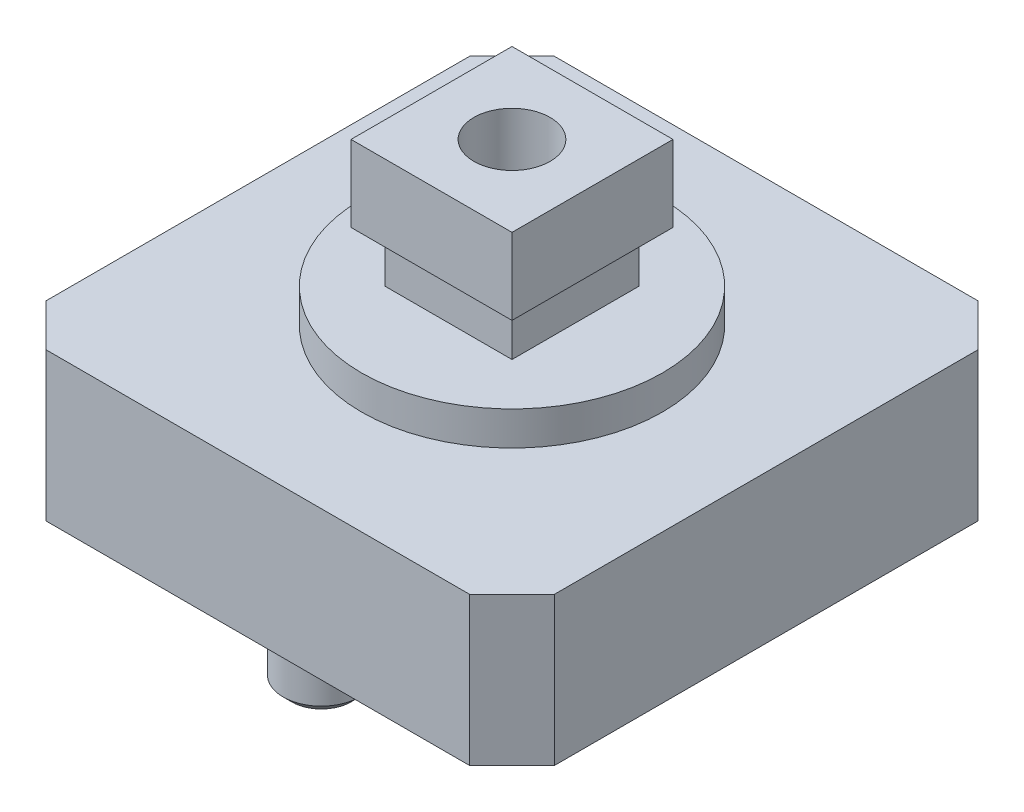
ISO-10303-21;
HEADER;
FILE_DESCRIPTION(('STEP AP214'),'2;1');
FILE_NAME('part.step','',(''),(''),'','','');
FILE_SCHEMA(('AUTOMOTIVE_DESIGN { 1 0 10303 214 1 1 1 1 }'));
ENDSEC;
DATA;
#1=APPLICATION_CONTEXT('core data for automotive mechanical design processes');
#2=APPLICATION_PROTOCOL_DEFINITION('international standard','automotive_design',2000,#1);
#3=PRODUCT_CONTEXT('',#1,'mechanical');
#4=PRODUCT('Part','Part','',(#3));
#5=PRODUCT_RELATED_PRODUCT_CATEGORY('part','',(#4));
#6=PRODUCT_DEFINITION_FORMATION('','',#4);
#7=PRODUCT_DEFINITION_CONTEXT('part definition',#1,'design');
#8=PRODUCT_DEFINITION('design','',#6,#7);
#9=PRODUCT_DEFINITION_SHAPE('','',#8);
#10=(LENGTH_UNIT() NAMED_UNIT(*) SI_UNIT(.MILLI.,.METRE.));
#11=(NAMED_UNIT(*) PLANE_ANGLE_UNIT() SI_UNIT($,.RADIAN.));
#12=(NAMED_UNIT(*) SI_UNIT($,.STERADIAN.) SOLID_ANGLE_UNIT());
#13=UNCERTAINTY_MEASURE_WITH_UNIT(LENGTH_MEASURE(1.E-05),#10,'distance_accuracy_value','');
#14=(GEOMETRIC_REPRESENTATION_CONTEXT(3) GLOBAL_UNCERTAINTY_ASSIGNED_CONTEXT((#13)) GLOBAL_UNIT_ASSIGNED_CONTEXT((#10,
#11,#12)) REPRESENTATION_CONTEXT('',''));
#15=CARTESIAN_POINT('',(0.,0.,0.));
#16=DIRECTION('',(0.,0.,1.));
#17=DIRECTION('',(1.,0.,0.));
#18=AXIS2_PLACEMENT_3D('',#15,#16,#17);
#19=CARTESIAN_POINT('',(0.,4.3,0.));
#20=DIRECTION('',(0.,1.,0.));
#21=DIRECTION('',(0.,0.,1.));
#22=AXIS2_PLACEMENT_3D('',#19,#20,#21);
#23=PLANE('',#22);
#24=CARTESIAN_POINT('',(0.,4.3,0.));
#25=DIRECTION('',(0.,1.,0.));
#26=DIRECTION('',(0.,0.,1.));
#27=AXIS2_PLACEMENT_3D('',#24,#25,#26);
#28=CIRCLE('',#27,3.55);
#29=CARTESIAN_POINT('',(0.,4.3,3.55));
#30=VERTEX_POINT('',#29);
#31=EDGE_CURVE('E274',#30,#30,#28,.T.);
#32=ORIENTED_EDGE('',*,*,#31,.T.);
#33=EDGE_LOOP('',(#32));
#34=FACE_BOUND('',#33,.T.);
#35=DIRECTION('',(1.,0.,0.));
#36=VECTOR('',#35,1.);
#37=CARTESIAN_POINT('',(1.5,4.3,1.5));
#38=LINE('',#37,#36);
#39=CARTESIAN_POINT('',(-1.5,4.3,1.5));
#40=VERTEX_POINT('',#39);
#41=CARTESIAN_POINT('',(1.5,4.3,1.5));
#42=VERTEX_POINT('',#41);
#43=EDGE_CURVE('E310',#40,#42,#38,.T.);
#44=ORIENTED_EDGE('',*,*,#43,.F.);
#45=DIRECTION('',(0.,0.,1.));
#46=VECTOR('',#45,1.);
#47=CARTESIAN_POINT('',(-1.5,4.3,1.5));
#48=LINE('',#47,#46);
#49=CARTESIAN_POINT('',(-1.5,4.3,-1.5));
#50=VERTEX_POINT('',#49);
#51=EDGE_CURVE('E313',#50,#40,#48,.T.);
#52=ORIENTED_EDGE('',*,*,#51,.F.);
#53=DIRECTION('',(-1.,0.,0.));
#54=VECTOR('',#53,1.);
#55=CARTESIAN_POINT('',(1.5,4.3,-1.5));
#56=LINE('',#55,#54);
#57=CARTESIAN_POINT('',(1.5,4.3,-1.5));
#58=VERTEX_POINT('',#57);
#59=EDGE_CURVE('E305',#58,#50,#56,.T.);
#60=ORIENTED_EDGE('',*,*,#59,.F.);
#61=DIRECTION('',(0.,0.,-1.));
#62=VECTOR('',#61,1.);
#63=CARTESIAN_POINT('',(1.5,4.3,1.5));
#64=LINE('',#63,#62);
#65=EDGE_CURVE('E308',#42,#58,#64,.T.);
#66=ORIENTED_EDGE('',*,*,#65,.F.);
#67=EDGE_LOOP('',(#44,#52,#60,#66));
#68=FACE_BOUND('',#67,.T.);
#69=ADVANCED_FACE('F32',(#34,#68),#23,.T.);
#70=CARTESIAN_POINT('',(0.,3.5,0.));
#71=DIRECTION('',(0.,-1.,0.));
#72=DIRECTION('',(0.,0.,-1.));
#73=AXIS2_PLACEMENT_3D('',#70,#71,#72);
#74=PLANE('',#73);
#75=DIRECTION('',(-1.,0.,0.));
#76=VECTOR('',#75,1.);
#77=CARTESIAN_POINT('',(-5.,3.5,-6.));
#78=LINE('',#77,#76);
#79=CARTESIAN_POINT('',(5.,3.5,-6.));
#80=VERTEX_POINT('',#79);
#81=CARTESIAN_POINT('',(-5.,3.5,-6.));
#82=VERTEX_POINT('',#81);
#83=EDGE_CURVE('E159',#80,#82,#78,.T.);
#84=ORIENTED_EDGE('',*,*,#83,.T.);
#85=DIRECTION('',(-0.707106781186548,0.,0.707106781186548));
#86=VECTOR('',#85,1.);
#87=CARTESIAN_POINT('',(-6.,3.5,-5.));
#88=LINE('',#87,#86);
#89=CARTESIAN_POINT('',(-6.,3.5,-5.));
#90=VERTEX_POINT('',#89);
#91=EDGE_CURVE('E98',#82,#90,#88,.T.);
#92=ORIENTED_EDGE('',*,*,#91,.T.);
#93=DIRECTION('',(0.,0.,1.));
#94=VECTOR('',#93,1.);
#95=CARTESIAN_POINT('',(-6.,3.5,-5.));
#96=LINE('',#95,#94);
#97=CARTESIAN_POINT('',(-6.,3.5,5.));
#98=VERTEX_POINT('',#97);
#99=EDGE_CURVE('E283',#90,#98,#96,.T.);
#100=ORIENTED_EDGE('',*,*,#99,.T.);
#101=DIRECTION('',(0.707106781186548,0.,0.707106781186548));
#102=VECTOR('',#101,1.);
#103=CARTESIAN_POINT('',(-6.,3.5,5.));
#104=LINE('',#103,#102);
#105=CARTESIAN_POINT('',(-5.,3.5,6.));
#106=VERTEX_POINT('',#105);
#107=EDGE_CURVE('E285',#98,#106,#104,.T.);
#108=ORIENTED_EDGE('',*,*,#107,.T.);
#109=DIRECTION('',(1.,0.,0.));
#110=VECTOR('',#109,1.);
#111=CARTESIAN_POINT('',(-5.,3.5,6.));
#112=LINE('',#111,#110);
#113=CARTESIAN_POINT('',(5.,3.5,6.));
#114=VERTEX_POINT('',#113);
#115=EDGE_CURVE('E122',#106,#114,#112,.T.);
#116=ORIENTED_EDGE('',*,*,#115,.T.);
#117=DIRECTION('',(0.707106781186548,0.,-0.707106781186548));
#118=VECTOR('',#117,1.);
#119=CARTESIAN_POINT('',(5.,3.5,6.));
#120=LINE('',#119,#118);
#121=CARTESIAN_POINT('',(6.,3.5,5.));
#122=VERTEX_POINT('',#121);
#123=EDGE_CURVE('E114',#114,#122,#120,.T.);
#124=ORIENTED_EDGE('',*,*,#123,.T.);
#125=DIRECTION('',(0.,0.,-1.));
#126=VECTOR('',#125,1.);
#127=CARTESIAN_POINT('',(6.,3.5,-5.));
#128=LINE('',#127,#126);
#129=CARTESIAN_POINT('',(6.,3.5,-5.));
#130=VERTEX_POINT('',#129);
#131=EDGE_CURVE('E119',#122,#130,#128,.T.);
#132=ORIENTED_EDGE('',*,*,#131,.T.);
#133=DIRECTION('',(-0.707106781186548,0.,-0.707106781186548));
#134=VECTOR('',#133,1.);
#135=CARTESIAN_POINT('',(5.,3.5,-6.));
#136=LINE('',#135,#134);
#137=EDGE_CURVE('E56',#130,#80,#136,.T.);
#138=ORIENTED_EDGE('',*,*,#137,.T.);
#139=EDGE_LOOP('',(#84,#92,#100,#108,#116,#124,#132,#138));
#140=FACE_BOUND('',#139,.T.);
#141=CARTESIAN_POINT('',(0.,3.5,0.));
#142=DIRECTION('',(0.,-1.,0.));
#143=DIRECTION('',(0.,0.,-1.));
#144=AXIS2_PLACEMENT_3D('',#141,#142,#143);
#145=CIRCLE('',#144,3.55);
#146=CARTESIAN_POINT('',(0.,3.5,-3.55));
#147=VERTEX_POINT('',#146);
#148=EDGE_CURVE('E11',#147,#147,#145,.F.);
#149=ORIENTED_EDGE('',*,*,#148,.F.);
#150=EDGE_LOOP('',(#149));
#151=FACE_BOUND('',#150,.T.);
#152=ADVANCED_FACE('F116',(#140,#151),#74,.F.);
#153=CARTESIAN_POINT('',(0.,0.,0.));
#154=DIRECTION('',(0.,-1.,0.));
#155=DIRECTION('',(0.,0.,-1.));
#156=AXIS2_PLACEMENT_3D('',#153,#154,#155);
#157=PLANE('',#156);
#158=CARTESIAN_POINT('',(0.,0.,-4.5));
#159=DIRECTION('',(0.,-1.,0.));
#160=DIRECTION('',(0.,0.,-1.));
#161=AXIS2_PLACEMENT_3D('',#158,#159,#160);
#162=CIRCLE('',#161,0.9);
#163=CARTESIAN_POINT('',(0.,0.,-5.4));
#164=VERTEX_POINT('',#163);
#165=EDGE_CURVE('E147',#164,#164,#162,.T.);
#166=ORIENTED_EDGE('',*,*,#165,.F.);
#167=EDGE_LOOP('',(#166));
#168=FACE_BOUND('',#167,.T.);
#169=DIRECTION('',(-1.,0.,0.));
#170=VECTOR('',#169,1.);
#171=CARTESIAN_POINT('',(-5.,0.,-6.));
#172=LINE('',#171,#170);
#173=CARTESIAN_POINT('',(5.,0.,-6.));
#174=VERTEX_POINT('',#173);
#175=CARTESIAN_POINT('',(-5.,0.,-6.));
#176=VERTEX_POINT('',#175);
#177=EDGE_CURVE('E143',#174,#176,#172,.T.);
#178=ORIENTED_EDGE('',*,*,#177,.F.);
#179=DIRECTION('',(-0.707106781186548,0.,-0.707106781186548));
#180=VECTOR('',#179,1.);
#181=CARTESIAN_POINT('',(5.,0.,-6.));
#182=LINE('',#181,#180);
#183=CARTESIAN_POINT('',(6.,0.,-5.));
#184=VERTEX_POINT('',#183);
#185=EDGE_CURVE('E89',#184,#174,#182,.T.);
#186=ORIENTED_EDGE('',*,*,#185,.F.);
#187=DIRECTION('',(0.,0.,-1.));
#188=VECTOR('',#187,1.);
#189=CARTESIAN_POINT('',(6.,0.,-5.));
#190=LINE('',#189,#188);
#191=CARTESIAN_POINT('',(6.,0.,5.));
#192=VERTEX_POINT('',#191);
#193=EDGE_CURVE('E156',#192,#184,#190,.T.);
#194=ORIENTED_EDGE('',*,*,#193,.F.);
#195=DIRECTION('',(0.707106781186548,0.,-0.707106781186548));
#196=VECTOR('',#195,1.);
#197=CARTESIAN_POINT('',(5.,0.,6.));
#198=LINE('',#197,#196);
#199=CARTESIAN_POINT('',(5.,0.,6.));
#200=VERTEX_POINT('',#199);
#201=EDGE_CURVE('E131',#200,#192,#198,.T.);
#202=ORIENTED_EDGE('',*,*,#201,.F.);
#203=DIRECTION('',(1.,0.,0.));
#204=VECTOR('',#203,1.);
#205=CARTESIAN_POINT('',(-5.,0.,6.));
#206=LINE('',#205,#204);
#207=CARTESIAN_POINT('',(-5.,0.,6.));
#208=VERTEX_POINT('',#207);
#209=EDGE_CURVE('E153',#208,#200,#206,.T.);
#210=ORIENTED_EDGE('',*,*,#209,.F.);
#211=DIRECTION('',(0.707106781186548,0.,0.707106781186548));
#212=VECTOR('',#211,1.);
#213=CARTESIAN_POINT('',(-6.,0.,5.));
#214=LINE('',#213,#212);
#215=CARTESIAN_POINT('',(-6.,0.,5.));
#216=VERTEX_POINT('',#215);
#217=EDGE_CURVE('E151',#216,#208,#214,.T.);
#218=ORIENTED_EDGE('',*,*,#217,.F.);
#219=DIRECTION('',(0.,0.,1.));
#220=VECTOR('',#219,1.);
#221=CARTESIAN_POINT('',(-6.,0.,-5.));
#222=LINE('',#221,#220);
#223=CARTESIAN_POINT('',(-6.,0.,-5.));
#224=VERTEX_POINT('',#223);
#225=EDGE_CURVE('E149',#224,#216,#222,.T.);
#226=ORIENTED_EDGE('',*,*,#225,.F.);
#227=DIRECTION('',(-0.707106781186548,0.,0.707106781186548));
#228=VECTOR('',#227,1.);
#229=CARTESIAN_POINT('',(-6.,0.,-5.));
#230=LINE('',#229,#228);
#231=EDGE_CURVE('E146',#176,#224,#230,.T.);
#232=ORIENTED_EDGE('',*,*,#231,.F.);
#233=EDGE_LOOP('',(#178,#186,#194,#202,#210,#218,#226,#232));
#234=FACE_BOUND('',#233,.T.);
#235=CARTESIAN_POINT('',(0.,0.,4.5));
#236=DIRECTION('',(0.,-1.,0.));
#237=DIRECTION('',(0.,0.,1.));
#238=AXIS2_PLACEMENT_3D('',#235,#236,#237);
#239=CIRCLE('',#238,0.9);
#240=CARTESIAN_POINT('',(0.,0.,5.4));
#241=VERTEX_POINT('',#240);
#242=EDGE_CURVE('E272',#241,#241,#239,.T.);
#243=ORIENTED_EDGE('',*,*,#242,.F.);
#244=EDGE_LOOP('',(#243));
#245=FACE_BOUND('',#244,.T.);
#246=ADVANCED_FACE('F213',(#168,#234,#245),#157,.T.);
#247=CARTESIAN_POINT('',(-5.,3.5,-6.));
#248=DIRECTION('',(0.,0.,1.));
#249=DIRECTION('',(1.,0.,0.));
#250=AXIS2_PLACEMENT_3D('',#247,#248,#249);
#251=PLANE('',#250);
#252=ORIENTED_EDGE('',*,*,#177,.T.);
#253=DIRECTION('',(0.,-1.,0.));
#254=VECTOR('',#253,1.);
#255=CARTESIAN_POINT('',(-5.,3.5,-6.));
#256=LINE('',#255,#254);
#257=EDGE_CURVE('E172',#82,#176,#256,.T.);
#258=ORIENTED_EDGE('',*,*,#257,.F.);
#259=ORIENTED_EDGE('',*,*,#83,.F.);
#260=DIRECTION('',(0.,-1.,0.));
#261=VECTOR('',#260,1.);
#262=CARTESIAN_POINT('',(5.,3.5,-6.));
#263=LINE('',#262,#261);
#264=EDGE_CURVE('E139',#80,#174,#263,.T.);
#265=ORIENTED_EDGE('',*,*,#264,.T.);
#266=EDGE_LOOP('',(#252,#258,#259,#265));
#267=FACE_BOUND('',#266,.T.);
#268=ADVANCED_FACE('F236',(#267),#251,.F.);
#269=CARTESIAN_POINT('',(-6.,3.5,-5.));
#270=DIRECTION('',(0.707106781186547,0.,0.707106781186547));
#271=DIRECTION('',(0.707106781186548,0.,-0.707106781186548));
#272=AXIS2_PLACEMENT_3D('',#269,#270,#271);
#273=PLANE('',#272);
#274=ORIENTED_EDGE('',*,*,#231,.T.);
#275=DIRECTION('',(0.,-1.,0.));
#276=VECTOR('',#275,1.);
#277=CARTESIAN_POINT('',(-6.,3.5,-5.));
#278=LINE('',#277,#276);
#279=EDGE_CURVE('E169',#90,#224,#278,.T.);
#280=ORIENTED_EDGE('',*,*,#279,.F.);
#281=ORIENTED_EDGE('',*,*,#91,.F.);
#282=ORIENTED_EDGE('',*,*,#257,.T.);
#283=EDGE_LOOP('',(#274,#280,#281,#282));
#284=FACE_BOUND('',#283,.T.);
#285=ADVANCED_FACE('F239',(#284),#273,.F.);
#286=CARTESIAN_POINT('',(-6.,3.5,-5.));
#287=DIRECTION('',(1.,0.,0.));
#288=DIRECTION('',(0.,0.,-1.));
#289=AXIS2_PLACEMENT_3D('',#286,#287,#288);
#290=PLANE('',#289);
#291=ORIENTED_EDGE('',*,*,#225,.T.);
#292=DIRECTION('',(0.,-1.,0.));
#293=VECTOR('',#292,1.);
#294=CARTESIAN_POINT('',(-6.,3.5,5.));
#295=LINE('',#294,#293);
#296=EDGE_CURVE('E166',#98,#216,#295,.T.);
#297=ORIENTED_EDGE('',*,*,#296,.F.);
#298=ORIENTED_EDGE('',*,*,#99,.F.);
#299=ORIENTED_EDGE('',*,*,#279,.T.);
#300=EDGE_LOOP('',(#291,#297,#298,#299));
#301=FACE_BOUND('',#300,.T.);
#302=ADVANCED_FACE('F243',(#301),#290,.F.);
#303=CARTESIAN_POINT('',(-6.,3.5,5.));
#304=DIRECTION('',(0.707106781186547,0.,-0.707106781186547));
#305=DIRECTION('',(-0.707106781186548,0.,-0.707106781186548));
#306=AXIS2_PLACEMENT_3D('',#303,#304,#305);
#307=PLANE('',#306);
#308=ORIENTED_EDGE('',*,*,#217,.T.);
#309=DIRECTION('',(0.,-1.,0.));
#310=VECTOR('',#309,1.);
#311=CARTESIAN_POINT('',(-5.,3.5,6.));
#312=LINE('',#311,#310);
#313=EDGE_CURVE('E163',#106,#208,#312,.T.);
#314=ORIENTED_EDGE('',*,*,#313,.F.);
#315=ORIENTED_EDGE('',*,*,#107,.F.);
#316=ORIENTED_EDGE('',*,*,#296,.T.);
#317=EDGE_LOOP('',(#308,#314,#315,#316));
#318=FACE_BOUND('',#317,.T.);
#319=ADVANCED_FACE('F246',(#318),#307,.F.);
#320=CARTESIAN_POINT('',(-5.,3.5,6.));
#321=DIRECTION('',(0.,0.,-1.));
#322=DIRECTION('',(-1.,0.,0.));
#323=AXIS2_PLACEMENT_3D('',#320,#321,#322);
#324=PLANE('',#323);
#325=ORIENTED_EDGE('',*,*,#209,.T.);
#326=DIRECTION('',(0.,-1.,0.));
#327=VECTOR('',#326,1.);
#328=CARTESIAN_POINT('',(5.,3.5,6.));
#329=LINE('',#328,#327);
#330=EDGE_CURVE('E134',#114,#200,#329,.T.);
#331=ORIENTED_EDGE('',*,*,#330,.F.);
#332=ORIENTED_EDGE('',*,*,#115,.F.);
#333=ORIENTED_EDGE('',*,*,#313,.T.);
#334=EDGE_LOOP('',(#325,#331,#332,#333));
#335=FACE_BOUND('',#334,.T.);
#336=ADVANCED_FACE('F250',(#335),#324,.F.);
#337=CARTESIAN_POINT('',(5.,3.5,6.));
#338=DIRECTION('',(-0.707106781186547,0.,-0.707106781186547));
#339=DIRECTION('',(-0.707106781186548,0.,0.707106781186548));
#340=AXIS2_PLACEMENT_3D('',#337,#338,#339);
#341=PLANE('',#340);
#342=ORIENTED_EDGE('',*,*,#201,.T.);
#343=DIRECTION('',(0.,-1.,0.));
#344=VECTOR('',#343,1.);
#345=CARTESIAN_POINT('',(6.,3.5,5.));
#346=LINE('',#345,#344);
#347=EDGE_CURVE('E128',#122,#192,#346,.T.);
#348=ORIENTED_EDGE('',*,*,#347,.F.);
#349=ORIENTED_EDGE('',*,*,#123,.F.);
#350=ORIENTED_EDGE('',*,*,#330,.T.);
#351=EDGE_LOOP('',(#342,#348,#349,#350));
#352=FACE_BOUND('',#351,.T.);
#353=ADVANCED_FACE('F129',(#352),#341,.F.);
#354=CARTESIAN_POINT('',(6.,3.5,-5.));
#355=DIRECTION('',(-1.,0.,0.));
#356=DIRECTION('',(0.,0.,1.));
#357=AXIS2_PLACEMENT_3D('',#354,#355,#356);
#358=PLANE('',#357);
#359=ORIENTED_EDGE('',*,*,#193,.T.);
#360=DIRECTION('',(0.,-1.,0.));
#361=VECTOR('',#360,1.);
#362=CARTESIAN_POINT('',(6.,3.5,-5.));
#363=LINE('',#362,#361);
#364=EDGE_CURVE('E135',#130,#184,#363,.T.);
#365=ORIENTED_EDGE('',*,*,#364,.F.);
#366=ORIENTED_EDGE('',*,*,#131,.F.);
#367=ORIENTED_EDGE('',*,*,#347,.T.);
#368=EDGE_LOOP('',(#359,#365,#366,#367));
#369=FACE_BOUND('',#368,.T.);
#370=ADVANCED_FACE('F137',(#369),#358,.F.);
#371=CARTESIAN_POINT('',(5.,3.5,-6.));
#372=DIRECTION('',(-0.707106781186547,0.,0.707106781186547));
#373=DIRECTION('',(0.707106781186548,0.,0.707106781186548));
#374=AXIS2_PLACEMENT_3D('',#371,#372,#373);
#375=PLANE('',#374);
#376=ORIENTED_EDGE('',*,*,#185,.T.);
#377=ORIENTED_EDGE('',*,*,#264,.F.);
#378=ORIENTED_EDGE('',*,*,#137,.F.);
#379=ORIENTED_EDGE('',*,*,#364,.T.);
#380=EDGE_LOOP('',(#376,#377,#378,#379));
#381=FACE_BOUND('',#380,.T.);
#382=ADVANCED_FACE('F205',(#381),#375,.F.);
#383=CARTESIAN_POINT('',(0.,-1.6,-4.5));
#384=DIRECTION('',(0.,1.,0.));
#385=DIRECTION('',(0.,0.,1.));
#386=AXIS2_PLACEMENT_3D('',#383,#384,#385);
#387=CYLINDRICAL_SURFACE('',#386,0.9);
#388=CARTESIAN_POINT('',(0.,-1.4,-4.5));
#389=DIRECTION('',(0.,-1.,0.));
#390=DIRECTION('',(0.,0.,-1.));
#391=AXIS2_PLACEMENT_3D('',#388,#389,#390);
#392=CIRCLE('',#391,0.9);
#393=CARTESIAN_POINT('',(0.,-1.4,-5.4));
#394=VERTEX_POINT('',#393);
#395=EDGE_CURVE('E40',#394,#394,#392,.F.);
#396=ORIENTED_EDGE('',*,*,#395,.T.);
#397=EDGE_LOOP('',(#396));
#398=FACE_BOUND('',#397,.T.);
#399=ORIENTED_EDGE('',*,*,#165,.T.);
#400=EDGE_LOOP('',(#399));
#401=FACE_BOUND('',#400,.T.);
#402=ADVANCED_FACE('F185',(#398,#401),#387,.T.);
#403=CARTESIAN_POINT('',(0.,-1.6,-4.5));
#404=DIRECTION('',(0.,-1.,0.));
#405=DIRECTION('',(0.,0.,-1.));
#406=AXIS2_PLACEMENT_3D('',#403,#404,#405);
#407=PLANE('',#406);
#408=CARTESIAN_POINT('',(0.,-1.6,-4.5));
#409=DIRECTION('',(0.,-1.,0.));
#410=DIRECTION('',(0.,0.,-1.));
#411=AXIS2_PLACEMENT_3D('',#408,#409,#410);
#412=CIRCLE('',#411,0.699999999999999);
#413=CARTESIAN_POINT('',(0.,-1.6,-5.2));
#414=VERTEX_POINT('',#413);
#415=EDGE_CURVE('E180',#414,#414,#412,.T.);
#416=ORIENTED_EDGE('',*,*,#415,.T.);
#417=EDGE_LOOP('',(#416));
#418=FACE_BOUND('',#417,.T.);
#419=ADVANCED_FACE('F194',(#418),#407,.T.);
#420=CARTESIAN_POINT('',(0.,-1.6,4.5));
#421=DIRECTION('',(0.,1.,0.));
#422=DIRECTION('',(0.,0.,1.));
#423=AXIS2_PLACEMENT_3D('',#420,#421,#422);
#424=CYLINDRICAL_SURFACE('',#423,0.9);
#425=CARTESIAN_POINT('',(0.,-1.4,4.5));
#426=DIRECTION('',(0.,1.,0.));
#427=DIRECTION('',(0.,0.,1.));
#428=AXIS2_PLACEMENT_3D('',#425,#426,#427);
#429=CIRCLE('',#428,0.9);
#430=CARTESIAN_POINT('',(0.,-1.4,5.4));
#431=VERTEX_POINT('',#430);
#432=EDGE_CURVE('E177',#431,#431,#429,.T.);
#433=ORIENTED_EDGE('',*,*,#432,.T.);
#434=EDGE_LOOP('',(#433));
#435=FACE_BOUND('',#434,.T.);
#436=ORIENTED_EDGE('',*,*,#242,.T.);
#437=EDGE_LOOP('',(#436));
#438=FACE_BOUND('',#437,.T.);
#439=ADVANCED_FACE('F196',(#435,#438),#424,.T.);
#440=CARTESIAN_POINT('',(0.,-1.6,4.5));
#441=DIRECTION('',(0.,1.,0.));
#442=DIRECTION('',(0.,0.,1.));
#443=AXIS2_PLACEMENT_3D('',#440,#441,#442);
#444=PLANE('',#443);
#445=CARTESIAN_POINT('',(0.,-1.6,4.5));
#446=DIRECTION('',(0.,1.,0.));
#447=DIRECTION('',(0.,0.,1.));
#448=AXIS2_PLACEMENT_3D('',#445,#446,#447);
#449=CIRCLE('',#448,0.699999999999999);
#450=CARTESIAN_POINT('',(0.,-1.6,5.2));
#451=VERTEX_POINT('',#450);
#452=EDGE_CURVE('E174',#451,#451,#449,.F.);
#453=ORIENTED_EDGE('',*,*,#452,.T.);
#454=EDGE_LOOP('',(#453));
#455=FACE_BOUND('',#454,.T.);
#456=ADVANCED_FACE('F202',(#455),#444,.F.);
#457=CARTESIAN_POINT('',(0.,-1.6,4.5));
#458=DIRECTION('',(0.,1.,0.));
#459=DIRECTION('',(0.,0.,1.));
#460=AXIS2_PLACEMENT_3D('',#457,#458,#459);
#461=CONICAL_SURFACE('',#460,0.699999999999999,0.785398163397445);
#462=ORIENTED_EDGE('',*,*,#432,.F.);
#463=EDGE_LOOP('',(#462));
#464=FACE_BOUND('',#463,.T.);
#465=ORIENTED_EDGE('',*,*,#452,.F.);
#466=EDGE_LOOP('',(#465));
#467=FACE_BOUND('',#466,.T.);
#468=ADVANCED_FACE('F191',(#464,#467),#461,.T.);
#469=CARTESIAN_POINT('',(0.,-1.6,-4.5));
#470=DIRECTION('',(0.,1.,0.));
#471=DIRECTION('',(0.,0.,1.));
#472=AXIS2_PLACEMENT_3D('',#469,#470,#471);
#473=CONICAL_SURFACE('',#472,0.699999999999999,0.785398163397445);
#474=ORIENTED_EDGE('',*,*,#395,.F.);
#475=EDGE_LOOP('',(#474));
#476=FACE_BOUND('',#475,.T.);
#477=ORIENTED_EDGE('',*,*,#415,.F.);
#478=EDGE_LOOP('',(#477));
#479=FACE_BOUND('',#478,.T.);
#480=ADVANCED_FACE('F34',(#476,#479),#473,.T.);
#481=CARTESIAN_POINT('',(0.,4.3,0.));
#482=DIRECTION('',(0.,-1.,0.));
#483=DIRECTION('',(0.,0.,-1.));
#484=AXIS2_PLACEMENT_3D('',#481,#482,#483);
#485=CYLINDRICAL_SURFACE('',#484,3.55);
#486=ORIENTED_EDGE('',*,*,#31,.F.);
#487=EDGE_LOOP('',(#486));
#488=FACE_BOUND('',#487,.T.);
#489=ORIENTED_EDGE('',*,*,#148,.T.);
#490=EDGE_LOOP('',(#489));
#491=FACE_BOUND('',#490,.T.);
#492=ADVANCED_FACE('F190',(#488,#491),#485,.T.);
#493=CARTESIAN_POINT('',(-1.5,5.5,1.5));
#494=DIRECTION('',(1.,0.,0.));
#495=DIRECTION('',(0.,0.,-1.));
#496=AXIS2_PLACEMENT_3D('',#493,#494,#495);
#497=PLANE('',#496);
#498=ORIENTED_EDGE('',*,*,#51,.T.);
#499=DIRECTION('',(0.,-1.,0.));
#500=VECTOR('',#499,1.);
#501=CARTESIAN_POINT('',(-1.5,5.5,1.5));
#502=LINE('',#501,#500);
#503=CARTESIAN_POINT('',(-1.5,5.5,1.5));
#504=VERTEX_POINT('',#503);
#505=EDGE_CURVE('E277',#504,#40,#502,.T.);
#506=ORIENTED_EDGE('',*,*,#505,.F.);
#507=DIRECTION('',(0.,0.,1.));
#508=VECTOR('',#507,1.);
#509=CARTESIAN_POINT('',(-1.5,5.5,1.5));
#510=LINE('',#509,#508);
#511=CARTESIAN_POINT('',(-1.5,5.5,-1.5));
#512=VERTEX_POINT('',#511);
#513=EDGE_CURVE('E307',#512,#504,#510,.T.);
#514=ORIENTED_EDGE('',*,*,#513,.F.);
#515=DIRECTION('',(0.,-1.,0.));
#516=VECTOR('',#515,1.);
#517=CARTESIAN_POINT('',(-1.5,5.5,-1.5));
#518=LINE('',#517,#516);
#519=EDGE_CURVE('E301',#512,#50,#518,.T.);
#520=ORIENTED_EDGE('',*,*,#519,.T.);
#521=EDGE_LOOP('',(#498,#506,#514,#520));
#522=FACE_BOUND('',#521,.T.);
#523=ADVANCED_FACE('F219',(#522),#497,.F.);
#524=CARTESIAN_POINT('',(1.5,5.5,1.5));
#525=DIRECTION('',(0.,0.,-1.));
#526=DIRECTION('',(-1.,0.,0.));
#527=AXIS2_PLACEMENT_3D('',#524,#525,#526);
#528=PLANE('',#527);
#529=ORIENTED_EDGE('',*,*,#43,.T.);
#530=DIRECTION('',(0.,-1.,0.));
#531=VECTOR('',#530,1.);
#532=CARTESIAN_POINT('',(1.5,5.5,1.5));
#533=LINE('',#532,#531);
#534=CARTESIAN_POINT('',(1.5,5.5,1.5));
#535=VERTEX_POINT('',#534);
#536=EDGE_CURVE('E297',#535,#42,#533,.T.);
#537=ORIENTED_EDGE('',*,*,#536,.F.);
#538=DIRECTION('',(1.,0.,0.));
#539=VECTOR('',#538,1.);
#540=CARTESIAN_POINT('',(1.5,5.5,1.5));
#541=LINE('',#540,#539);
#542=EDGE_CURVE('E322',#504,#535,#541,.T.);
#543=ORIENTED_EDGE('',*,*,#542,.F.);
#544=ORIENTED_EDGE('',*,*,#505,.T.);
#545=EDGE_LOOP('',(#529,#537,#543,#544));
#546=FACE_BOUND('',#545,.T.);
#547=ADVANCED_FACE('F435',(#546),#528,.F.);
#548=CARTESIAN_POINT('',(1.5,5.5,1.5));
#549=DIRECTION('',(-1.,0.,0.));
#550=DIRECTION('',(0.,0.,1.));
#551=AXIS2_PLACEMENT_3D('',#548,#549,#550);
#552=PLANE('',#551);
#553=ORIENTED_EDGE('',*,*,#65,.T.);
#554=DIRECTION('',(0.,-1.,0.));
#555=VECTOR('',#554,1.);
#556=CARTESIAN_POINT('',(1.5,5.5,-1.5));
#557=LINE('',#556,#555);
#558=CARTESIAN_POINT('',(1.5,5.5,-1.5));
#559=VERTEX_POINT('',#558);
#560=EDGE_CURVE('E47',#559,#58,#557,.T.);
#561=ORIENTED_EDGE('',*,*,#560,.F.);
#562=DIRECTION('',(0.,0.,-1.));
#563=VECTOR('',#562,1.);
#564=CARTESIAN_POINT('',(1.5,5.5,1.5));
#565=LINE('',#564,#563);
#566=EDGE_CURVE('E319',#535,#559,#565,.T.);
#567=ORIENTED_EDGE('',*,*,#566,.F.);
#568=ORIENTED_EDGE('',*,*,#536,.T.);
#569=EDGE_LOOP('',(#553,#561,#567,#568));
#570=FACE_BOUND('',#569,.T.);
#571=ADVANCED_FACE('F433',(#570),#552,.F.);
#572=CARTESIAN_POINT('',(1.5,5.5,-1.5));
#573=DIRECTION('',(0.,0.,1.));
#574=DIRECTION('',(1.,0.,0.));
#575=AXIS2_PLACEMENT_3D('',#572,#573,#574);
#576=PLANE('',#575);
#577=ORIENTED_EDGE('',*,*,#59,.T.);
#578=ORIENTED_EDGE('',*,*,#519,.F.);
#579=DIRECTION('',(-1.,0.,0.));
#580=VECTOR('',#579,1.);
#581=CARTESIAN_POINT('',(1.5,5.5,-1.5));
#582=LINE('',#581,#580);
#583=EDGE_CURVE('E304',#559,#512,#582,.T.);
#584=ORIENTED_EDGE('',*,*,#583,.F.);
#585=ORIENTED_EDGE('',*,*,#560,.T.);
#586=EDGE_LOOP('',(#577,#578,#584,#585));
#587=FACE_BOUND('',#586,.T.);
#588=ADVANCED_FACE('F427',(#587),#576,.F.);
#589=CARTESIAN_POINT('',(0.,5.5,0.));
#590=DIRECTION('',(0.,1.,0.));
#591=DIRECTION('',(0.,0.,1.));
#592=AXIS2_PLACEMENT_3D('',#589,#590,#591);
#593=PLANE('',#592);
#594=DIRECTION('',(0.,0.,1.));
#595=VECTOR('',#594,1.);
#596=CARTESIAN_POINT('',(-1.9,5.5,1.9));
#597=LINE('',#596,#595);
#598=CARTESIAN_POINT('',(-1.9,5.5,-1.9));
#599=VERTEX_POINT('',#598);
#600=CARTESIAN_POINT('',(-1.9,5.5,1.9));
#601=VERTEX_POINT('',#600);
#602=EDGE_CURVE('E349',#599,#601,#597,.T.);
#603=ORIENTED_EDGE('',*,*,#602,.F.);
#604=DIRECTION('',(-1.,0.,0.));
#605=VECTOR('',#604,1.);
#606=CARTESIAN_POINT('',(1.9,5.5,-1.9));
#607=LINE('',#606,#605);
#608=CARTESIAN_POINT('',(1.9,5.5,-1.9));
#609=VERTEX_POINT('',#608);
#610=EDGE_CURVE('E339',#609,#599,#607,.T.);
#611=ORIENTED_EDGE('',*,*,#610,.F.);
#612=DIRECTION('',(0.,0.,-1.));
#613=VECTOR('',#612,1.);
#614=CARTESIAN_POINT('',(1.9,5.5,1.9));
#615=LINE('',#614,#613);
#616=CARTESIAN_POINT('',(1.9,5.5,1.9));
#617=VERTEX_POINT('',#616);
#618=EDGE_CURVE('E343',#617,#609,#615,.T.);
#619=ORIENTED_EDGE('',*,*,#618,.F.);
#620=DIRECTION('',(1.,0.,0.));
#621=VECTOR('',#620,1.);
#622=CARTESIAN_POINT('',(1.9,5.5,1.9));
#623=LINE('',#622,#621);
#624=EDGE_CURVE('E346',#601,#617,#623,.T.);
#625=ORIENTED_EDGE('',*,*,#624,.F.);
#626=EDGE_LOOP('',(#603,#611,#619,#625));
#627=FACE_BOUND('',#626,.T.);
#628=ORIENTED_EDGE('',*,*,#583,.T.);
#629=ORIENTED_EDGE('',*,*,#513,.T.);
#630=ORIENTED_EDGE('',*,*,#542,.T.);
#631=ORIENTED_EDGE('',*,*,#566,.T.);
#632=EDGE_LOOP('',(#628,#629,#630,#631));
#633=FACE_BOUND('',#632,.T.);
#634=ADVANCED_FACE('F437',(#627,#633),#593,.F.);
#635=CARTESIAN_POINT('',(-1.9,7.3,1.9));
#636=DIRECTION('',(1.,0.,0.));
#637=DIRECTION('',(0.,0.,-1.));
#638=AXIS2_PLACEMENT_3D('',#635,#636,#637);
#639=PLANE('',#638);
#640=ORIENTED_EDGE('',*,*,#602,.T.);
#641=DIRECTION('',(0.,-1.,0.));
#642=VECTOR('',#641,1.);
#643=CARTESIAN_POINT('',(-1.9,7.3,1.9));
#644=LINE('',#643,#642);
#645=CARTESIAN_POINT('',(-1.9,7.3,1.9));
#646=VERTEX_POINT('',#645);
#647=EDGE_CURVE('E316',#646,#601,#644,.T.);
#648=ORIENTED_EDGE('',*,*,#647,.F.);
#649=DIRECTION('',(0.,0.,1.));
#650=VECTOR('',#649,1.);
#651=CARTESIAN_POINT('',(-1.9,7.3,1.9));
#652=LINE('',#651,#650);
#653=CARTESIAN_POINT('',(-1.9,7.3,-1.9));
#654=VERTEX_POINT('',#653);
#655=EDGE_CURVE('E342',#654,#646,#652,.T.);
#656=ORIENTED_EDGE('',*,*,#655,.F.);
#657=DIRECTION('',(0.,-1.,0.));
#658=VECTOR('',#657,1.);
#659=CARTESIAN_POINT('',(-1.9,7.3,-1.9));
#660=LINE('',#659,#658);
#661=EDGE_CURVE('E335',#654,#599,#660,.T.);
#662=ORIENTED_EDGE('',*,*,#661,.T.);
#663=EDGE_LOOP('',(#640,#648,#656,#662));
#664=FACE_BOUND('',#663,.T.);
#665=ADVANCED_FACE('F394',(#664),#639,.F.);
#666=CARTESIAN_POINT('',(1.9,7.3,1.9));
#667=DIRECTION('',(0.,0.,-1.));
#668=DIRECTION('',(-1.,0.,0.));
#669=AXIS2_PLACEMENT_3D('',#666,#667,#668);
#670=PLANE('',#669);
#671=ORIENTED_EDGE('',*,*,#624,.T.);
#672=DIRECTION('',(0.,-1.,0.));
#673=VECTOR('',#672,1.);
#674=CARTESIAN_POINT('',(1.9,7.3,1.9));
#675=LINE('',#674,#673);
#676=CARTESIAN_POINT('',(1.9,7.3,1.9));
#677=VERTEX_POINT('',#676);
#678=EDGE_CURVE('E329',#677,#617,#675,.T.);
#679=ORIENTED_EDGE('',*,*,#678,.F.);
#680=DIRECTION('',(1.,0.,0.));
#681=VECTOR('',#680,1.);
#682=CARTESIAN_POINT('',(1.9,7.3,1.9));
#683=LINE('',#682,#681);
#684=EDGE_CURVE('E358',#646,#677,#683,.T.);
#685=ORIENTED_EDGE('',*,*,#684,.F.);
#686=ORIENTED_EDGE('',*,*,#647,.T.);
#687=EDGE_LOOP('',(#671,#679,#685,#686));
#688=FACE_BOUND('',#687,.T.);
#689=ADVANCED_FACE('F398',(#688),#670,.F.);
#690=CARTESIAN_POINT('',(1.9,7.3,1.9));
#691=DIRECTION('',(-1.,0.,0.));
#692=DIRECTION('',(0.,0.,1.));
#693=AXIS2_PLACEMENT_3D('',#690,#691,#692);
#694=PLANE('',#693);
#695=ORIENTED_EDGE('',*,*,#618,.T.);
#696=DIRECTION('',(0.,-1.,0.));
#697=VECTOR('',#696,1.);
#698=CARTESIAN_POINT('',(1.9,7.3,-1.9));
#699=LINE('',#698,#697);
#700=CARTESIAN_POINT('',(1.9,7.3,-1.9));
#701=VERTEX_POINT('',#700);
#702=EDGE_CURVE('E332',#701,#609,#699,.T.);
#703=ORIENTED_EDGE('',*,*,#702,.F.);
#704=DIRECTION('',(0.,0.,-1.));
#705=VECTOR('',#704,1.);
#706=CARTESIAN_POINT('',(1.9,7.3,1.9));
#707=LINE('',#706,#705);
#708=EDGE_CURVE('E355',#677,#701,#707,.T.);
#709=ORIENTED_EDGE('',*,*,#708,.F.);
#710=ORIENTED_EDGE('',*,*,#678,.T.);
#711=EDGE_LOOP('',(#695,#703,#709,#710));
#712=FACE_BOUND('',#711,.T.);
#713=ADVANCED_FACE('F449',(#712),#694,.F.);
#714=CARTESIAN_POINT('',(1.9,7.3,-1.9));
#715=DIRECTION('',(0.,0.,1.));
#716=DIRECTION('',(1.,0.,0.));
#717=AXIS2_PLACEMENT_3D('',#714,#715,#716);
#718=PLANE('',#717);
#719=ORIENTED_EDGE('',*,*,#610,.T.);
#720=ORIENTED_EDGE('',*,*,#661,.F.);
#721=DIRECTION('',(-1.,0.,0.));
#722=VECTOR('',#721,1.);
#723=CARTESIAN_POINT('',(1.9,7.3,-1.9));
#724=LINE('',#723,#722);
#725=EDGE_CURVE('E338',#701,#654,#724,.T.);
#726=ORIENTED_EDGE('',*,*,#725,.F.);
#727=ORIENTED_EDGE('',*,*,#702,.T.);
#728=EDGE_LOOP('',(#719,#720,#726,#727));
#729=FACE_BOUND('',#728,.T.);
#730=ADVANCED_FACE('F380',(#729),#718,.F.);
#731=CARTESIAN_POINT('',(0.,7.3,0.));
#732=DIRECTION('',(0.,1.,0.));
#733=DIRECTION('',(0.,0.,1.));
#734=AXIS2_PLACEMENT_3D('',#731,#732,#733);
#735=PLANE('',#734);
#736=CARTESIAN_POINT('',(0.,7.3,0.));
#737=DIRECTION('',(0.,1.,0.));
#738=DIRECTION('',(0.,0.,1.));
#739=AXIS2_PLACEMENT_3D('',#736,#737,#738);
#740=CIRCLE('',#739,0.9);
#741=CARTESIAN_POINT('',(0.,7.3,0.9));
#742=VERTEX_POINT('',#741);
#743=EDGE_CURVE('E363',#742,#742,#740,.T.);
#744=ORIENTED_EDGE('',*,*,#743,.F.);
#745=EDGE_LOOP('',(#744));
#746=FACE_BOUND('',#745,.T.);
#747=ORIENTED_EDGE('',*,*,#655,.T.);
#748=ORIENTED_EDGE('',*,*,#684,.T.);
#749=ORIENTED_EDGE('',*,*,#708,.T.);
#750=ORIENTED_EDGE('',*,*,#725,.T.);
#751=EDGE_LOOP('',(#747,#748,#749,#750));
#752=FACE_BOUND('',#751,.T.);
#753=ADVANCED_FACE('F374',(#746,#752),#735,.T.);
#754=CARTESIAN_POINT('',(0.,5.3,0.));
#755=DIRECTION('',(0.,1.,0.));
#756=DIRECTION('',(0.,0.,1.));
#757=AXIS2_PLACEMENT_3D('',#754,#755,#756);
#758=CYLINDRICAL_SURFACE('',#757,0.9);
#759=CARTESIAN_POINT('',(0.,5.3,0.));
#760=DIRECTION('',(0.,1.,0.));
#761=DIRECTION('',(0.,0.,1.));
#762=AXIS2_PLACEMENT_3D('',#759,#760,#761);
#763=CIRCLE('',#762,0.9);
#764=CARTESIAN_POINT('',(0.,5.3,0.9));
#765=VERTEX_POINT('',#764);
#766=EDGE_CURVE('E352',#765,#765,#763,.T.);
#767=ORIENTED_EDGE('',*,*,#766,.F.);
#768=EDGE_LOOP('',(#767));
#769=FACE_BOUND('',#768,.T.);
#770=ORIENTED_EDGE('',*,*,#743,.T.);
#771=EDGE_LOOP('',(#770));
#772=FACE_BOUND('',#771,.T.);
#773=ADVANCED_FACE('F371',(#769,#772),#758,.F.);
#774=CARTESIAN_POINT('',(0.,5.3,0.));
#775=DIRECTION('',(0.,1.,0.));
#776=DIRECTION('',(0.,0.,1.));
#777=AXIS2_PLACEMENT_3D('',#774,#775,#776);
#778=PLANE('',#777);
#779=ORIENTED_EDGE('',*,*,#766,.T.);
#780=EDGE_LOOP('',(#779));
#781=FACE_BOUND('',#780,.T.);
#782=ADVANCED_FACE('F369',(#781),#778,.T.);
#783=CLOSED_SHELL('',(#69,#152,#246,#268,#285,#302,#319,#336,#353,#370,#382,#402,#419,#439,#456,
#468,#480,#492,#523,#547,#571,#588,#634,#665,#689,#713,#730,#753,#773,#782));
#784=MANIFOLD_SOLID_BREP('B2',#783);
#785=ADVANCED_BREP_SHAPE_REPRESENTATION('',(#18,#784),#14);
#786=SHAPE_DEFINITION_REPRESENTATION(#9,#785);
ENDSEC;
END-ISO-10303-21;
